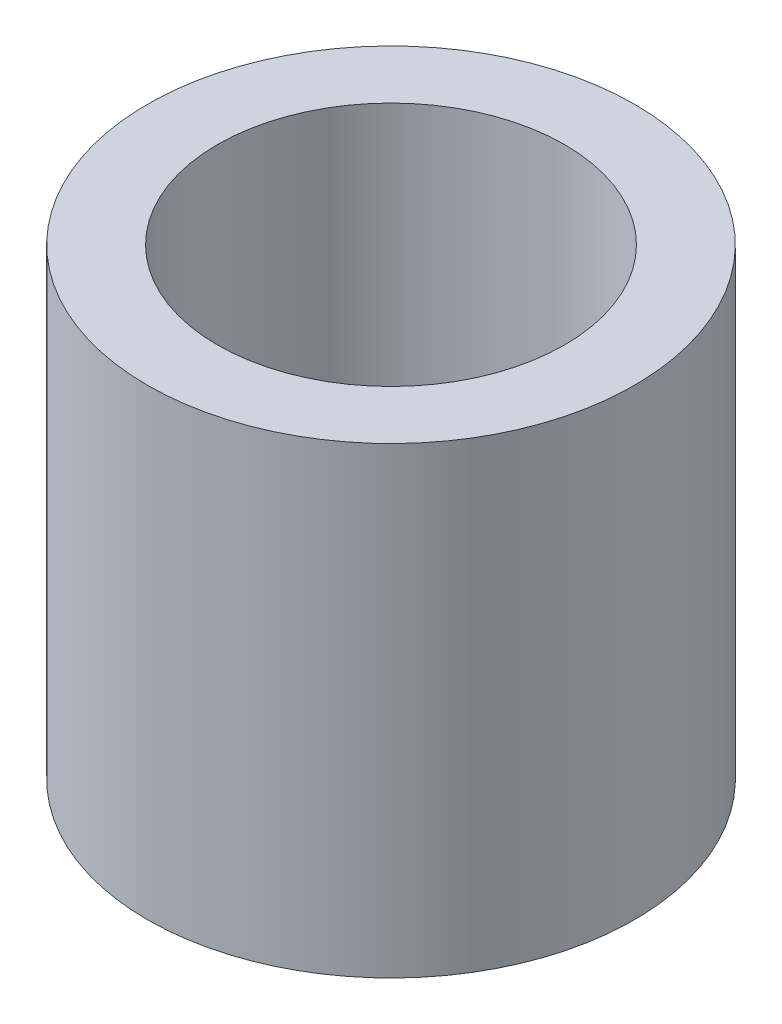
ISO-10303-21;
HEADER;
FILE_DESCRIPTION(('STEP AP214'),'2;1');
FILE_NAME('part.step','',(''),(''),'','','');
FILE_SCHEMA(('AUTOMOTIVE_DESIGN { 1 0 10303 214 1 1 1 1 }'));
ENDSEC;
DATA;
#1=APPLICATION_CONTEXT('core data for automotive mechanical design processes');
#2=APPLICATION_PROTOCOL_DEFINITION('international standard','automotive_design',2000,#1);
#3=PRODUCT_CONTEXT('',#1,'mechanical');
#4=PRODUCT('Part','Part','',(#3));
#5=PRODUCT_RELATED_PRODUCT_CATEGORY('part','',(#4));
#6=PRODUCT_DEFINITION_FORMATION('','',#4);
#7=PRODUCT_DEFINITION_CONTEXT('part definition',#1,'design');
#8=PRODUCT_DEFINITION('design','',#6,#7);
#9=PRODUCT_DEFINITION_SHAPE('','',#8);
#10=(LENGTH_UNIT() NAMED_UNIT(*) SI_UNIT(.MILLI.,.METRE.));
#11=(NAMED_UNIT(*) PLANE_ANGLE_UNIT() SI_UNIT($,.RADIAN.));
#12=(NAMED_UNIT(*) SI_UNIT($,.STERADIAN.) SOLID_ANGLE_UNIT());
#13=UNCERTAINTY_MEASURE_WITH_UNIT(LENGTH_MEASURE(1.E-05),#10,'distance_accuracy_value','');
#14=(GEOMETRIC_REPRESENTATION_CONTEXT(3) GLOBAL_UNCERTAINTY_ASSIGNED_CONTEXT((#13)) GLOBAL_UNIT_ASSIGNED_CONTEXT((#10,
#11,#12)) REPRESENTATION_CONTEXT('',''));
#15=CARTESIAN_POINT('',(0.,0.,0.));
#16=DIRECTION('',(0.,0.,1.));
#17=DIRECTION('',(1.,0.,0.));
#18=AXIS2_PLACEMENT_3D('',#15,#16,#17);
#19=CARTESIAN_POINT('',(0.,0.,0.));
#20=DIRECTION('',(0.,1.,0.));
#21=DIRECTION('',(1.,0.,0.));
#22=AXIS2_PLACEMENT_3D('',#19,#20,#21);
#23=PLANE('',#22);
#24=CARTESIAN_POINT('',(0.,0.,0.));
#25=DIRECTION('',(0.,1.,0.));
#26=DIRECTION('',(0.,0.,1.));
#27=AXIS2_PLACEMENT_3D('',#24,#25,#26);
#28=CIRCLE('',#27,4.7625);
#29=CARTESIAN_POINT('',(0.,0.,4.7625));
#30=VERTEX_POINT('',#29);
#31=EDGE_CURVE('E28',#30,#30,#28,.T.);
#32=ORIENTED_EDGE('',*,*,#31,.T.);
#33=EDGE_LOOP('',(#32));
#34=FACE_BOUND('',#33,.T.);
#35=CARTESIAN_POINT('',(0.,0.,0.));
#36=DIRECTION('',(0.,1.,0.));
#37=DIRECTION('',(0.,0.,1.));
#38=AXIS2_PLACEMENT_3D('',#35,#36,#37);
#39=CIRCLE('',#38,6.6802);
#40=CARTESIAN_POINT('',(0.,0.,6.6802));
#41=VERTEX_POINT('',#40);
#42=EDGE_CURVE('E10',#41,#41,#39,.T.);
#43=ORIENTED_EDGE('',*,*,#42,.F.);
#44=EDGE_LOOP('',(#43));
#45=FACE_BOUND('',#44,.T.);
#46=ADVANCED_FACE('F14',(#34,#45),#23,.F.);
#47=CARTESIAN_POINT('',(0.,12.7,0.));
#48=DIRECTION('',(0.,1.,0.));
#49=DIRECTION('',(1.,0.,0.));
#50=AXIS2_PLACEMENT_3D('',#47,#48,#49);
#51=PLANE('',#50);
#52=CARTESIAN_POINT('',(0.,12.7,0.));
#53=DIRECTION('',(0.,1.,0.));
#54=DIRECTION('',(0.,0.,1.));
#55=AXIS2_PLACEMENT_3D('',#52,#53,#54);
#56=CIRCLE('',#55,4.7625);
#57=CARTESIAN_POINT('',(0.,12.7,4.7625));
#58=VERTEX_POINT('',#57);
#59=EDGE_CURVE('E40',#58,#58,#56,.T.);
#60=ORIENTED_EDGE('',*,*,#59,.F.);
#61=EDGE_LOOP('',(#60));
#62=FACE_BOUND('',#61,.T.);
#63=CARTESIAN_POINT('',(0.,12.7,0.));
#64=DIRECTION('',(0.,1.,0.));
#65=DIRECTION('',(0.,0.,1.));
#66=AXIS2_PLACEMENT_3D('',#63,#64,#65);
#67=CIRCLE('',#66,6.6802);
#68=CARTESIAN_POINT('',(0.,12.7,6.6802));
#69=VERTEX_POINT('',#68);
#70=EDGE_CURVE('E21',#69,#69,#67,.T.);
#71=ORIENTED_EDGE('',*,*,#70,.T.);
#72=EDGE_LOOP('',(#71));
#73=FACE_BOUND('',#72,.T.);
#74=ADVANCED_FACE('F48',(#62,#73),#51,.T.);
#75=CARTESIAN_POINT('',(0.,12.7,0.));
#76=DIRECTION('',(0.,-1.,0.));
#77=DIRECTION('',(0.,0.,-1.));
#78=AXIS2_PLACEMENT_3D('',#75,#76,#77);
#79=CYLINDRICAL_SURFACE('',#78,6.6802);
#80=ORIENTED_EDGE('',*,*,#42,.T.);
#81=EDGE_LOOP('',(#80));
#82=FACE_BOUND('',#81,.T.);
#83=ORIENTED_EDGE('',*,*,#70,.F.);
#84=EDGE_LOOP('',(#83));
#85=FACE_BOUND('',#84,.T.);
#86=ADVANCED_FACE('F49',(#82,#85),#79,.T.);
#87=CARTESIAN_POINT('',(0.,12.7,0.));
#88=DIRECTION('',(0.,-1.,0.));
#89=DIRECTION('',(0.,0.,-1.));
#90=AXIS2_PLACEMENT_3D('',#87,#88,#89);
#91=CYLINDRICAL_SURFACE('',#90,4.7625);
#92=ORIENTED_EDGE('',*,*,#31,.F.);
#93=EDGE_LOOP('',(#92));
#94=FACE_BOUND('',#93,.T.);
#95=ORIENTED_EDGE('',*,*,#59,.T.);
#96=EDGE_LOOP('',(#95));
#97=FACE_BOUND('',#96,.T.);
#98=ADVANCED_FACE('F46',(#94,#97),#91,.F.);
#99=CLOSED_SHELL('',(#46,#74,#86,#98));
#100=MANIFOLD_SOLID_BREP('B1',#99);
#101=ADVANCED_BREP_SHAPE_REPRESENTATION('',(#18,#100),#14);
#102=SHAPE_DEFINITION_REPRESENTATION(#9,#101);
ENDSEC;
END-ISO-10303-21;
